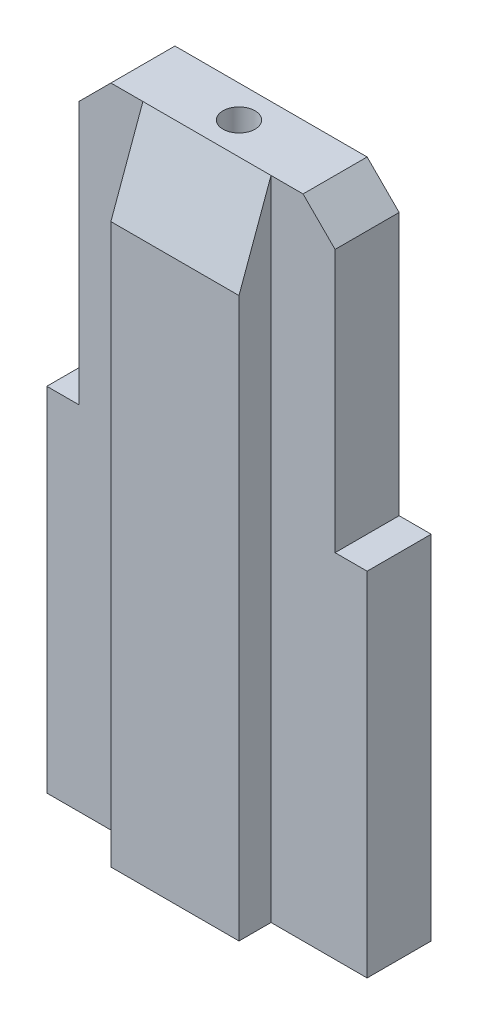
ISO-10303-21;
HEADER;
FILE_DESCRIPTION(('STEP AP214'),'2;1');
FILE_NAME('part.step','',(''),(''),'','','');
FILE_SCHEMA(('AUTOMOTIVE_DESIGN { 1 0 10303 214 1 1 1 1 }'));
ENDSEC;
DATA;
#1=APPLICATION_CONTEXT('core data for automotive mechanical design processes');
#2=APPLICATION_PROTOCOL_DEFINITION('international standard','automotive_design',2000,#1);
#3=PRODUCT_CONTEXT('',#1,'mechanical');
#4=PRODUCT('Part','Part','',(#3));
#5=PRODUCT_RELATED_PRODUCT_CATEGORY('part','',(#4));
#6=PRODUCT_DEFINITION_FORMATION('','',#4);
#7=PRODUCT_DEFINITION_CONTEXT('part definition',#1,'design');
#8=PRODUCT_DEFINITION('design','',#6,#7);
#9=PRODUCT_DEFINITION_SHAPE('','',#8);
#10=(LENGTH_UNIT() NAMED_UNIT(*) SI_UNIT(.MILLI.,.METRE.));
#11=(NAMED_UNIT(*) PLANE_ANGLE_UNIT() SI_UNIT($,.RADIAN.));
#12=(NAMED_UNIT(*) SI_UNIT($,.STERADIAN.) SOLID_ANGLE_UNIT());
#13=UNCERTAINTY_MEASURE_WITH_UNIT(LENGTH_MEASURE(1.E-05),#10,'distance_accuracy_value','');
#14=(GEOMETRIC_REPRESENTATION_CONTEXT(3) GLOBAL_UNCERTAINTY_ASSIGNED_CONTEXT((#13)) GLOBAL_UNIT_ASSIGNED_CONTEXT((#10,
#11,#12)) REPRESENTATION_CONTEXT('',''));
#15=CARTESIAN_POINT('',(0.,0.,0.));
#16=DIRECTION('',(0.,0.,1.));
#17=DIRECTION('',(1.,0.,0.));
#18=AXIS2_PLACEMENT_3D('',#15,#16,#17);
#19=CARTESIAN_POINT('',(0.,0.,-0.5));
#20=DIRECTION('',(0.,0.,1.));
#21=DIRECTION('',(1.,0.,0.));
#22=AXIS2_PLACEMENT_3D('',#19,#20,#21);
#23=PLANE('',#22);
#24=DIRECTION('',(0.,-1.,0.));
#25=VECTOR('',#24,1.);
#26=CARTESIAN_POINT('',(-2.,2.75,-0.5));
#27=LINE('',#26,#25);
#28=CARTESIAN_POINT('',(-2.,6.85,-0.5));
#29=VERTEX_POINT('',#28);
#30=CARTESIAN_POINT('',(-2.,2.75,-0.5));
#31=VERTEX_POINT('',#30);
#32=EDGE_CURVE('E267',#29,#31,#27,.T.);
#33=ORIENTED_EDGE('',*,*,#32,.F.);
#34=DIRECTION('',(-0.707106781186549,-0.707106781186546,0.));
#35=VECTOR('',#34,1.);
#36=CARTESIAN_POINT('',(-2.,6.85,-0.5));
#37=LINE('',#36,#35);
#38=CARTESIAN_POINT('',(-1.49999999999999,7.35,-0.5));
#39=VERTEX_POINT('',#38);
#40=EDGE_CURVE('E218',#29,#39,#37,.F.);
#41=ORIENTED_EDGE('',*,*,#40,.T.);
#42=DIRECTION('',(-1.,0.,0.));
#43=VECTOR('',#42,1.);
#44=CARTESIAN_POINT('',(-2.,7.35,-0.5));
#45=LINE('',#44,#43);
#46=CARTESIAN_POINT('',(-1.,7.35,-0.5));
#47=VERTEX_POINT('',#46);
#48=EDGE_CURVE('E264',#47,#39,#45,.T.);
#49=ORIENTED_EDGE('',*,*,#48,.F.);
#50=DIRECTION('',(0.,1.,0.));
#51=VECTOR('',#50,1.);
#52=CARTESIAN_POINT('',(-1.,7.35,-0.5));
#53=LINE('',#52,#51);
#54=CARTESIAN_POINT('',(-1.,-2.75,-0.5));
#55=VERTEX_POINT('',#54);
#56=EDGE_CURVE('E194',#55,#47,#53,.T.);
#57=ORIENTED_EDGE('',*,*,#56,.F.);
#58=DIRECTION('',(1.,0.,0.));
#59=VECTOR('',#58,1.);
#60=CARTESIAN_POINT('',(-2.5,-2.75,-0.5));
#61=LINE('',#60,#59);
#62=CARTESIAN_POINT('',(-2.5,-2.75,-0.5));
#63=VERTEX_POINT('',#62);
#64=EDGE_CURVE('E381',#63,#55,#61,.T.);
#65=ORIENTED_EDGE('',*,*,#64,.F.);
#66=DIRECTION('',(0.,-1.,0.));
#67=VECTOR('',#66,1.);
#68=CARTESIAN_POINT('',(-2.5,2.75,-0.5));
#69=LINE('',#68,#67);
#70=CARTESIAN_POINT('',(-2.5,2.75,-0.5));
#71=VERTEX_POINT('',#70);
#72=EDGE_CURVE('E418',#71,#63,#69,.T.);
#73=ORIENTED_EDGE('',*,*,#72,.F.);
#74=DIRECTION('',(-1.,0.,0.));
#75=VECTOR('',#74,1.);
#76=CARTESIAN_POINT('',(-2.5,2.75,-0.5));
#77=LINE('',#76,#75);
#78=EDGE_CURVE('E437',#31,#71,#77,.T.);
#79=ORIENTED_EDGE('',*,*,#78,.F.);
#80=EDGE_LOOP('',(#33,#41,#49,#57,#65,#73,#79));
#81=FACE_BOUND('',#80,.T.);
#82=ADVANCED_FACE('F32',(#81),#23,.F.);
#83=CARTESIAN_POINT('',(1.5,7.35,-0.5));
#84=VERTEX_POINT('',#83);
#85=CARTESIAN_POINT('',(0.999999999999999,7.35,-0.5));
#86=VERTEX_POINT('',#85);
#87=EDGE_CURVE('E230',#84,#86,#45,.T.);
#88=ORIENTED_EDGE('',*,*,#87,.F.);
#89=DIRECTION('',(-0.707106781186546,0.707106781186549,0.));
#90=VECTOR('',#89,1.);
#91=CARTESIAN_POINT('',(1.5,7.35,-0.5));
#92=LINE('',#91,#90);
#93=CARTESIAN_POINT('',(2.,6.85,-0.5));
#94=VERTEX_POINT('',#93);
#95=EDGE_CURVE('E55',#84,#94,#92,.F.);
#96=ORIENTED_EDGE('',*,*,#95,.T.);
#97=DIRECTION('',(0.,1.,0.));
#98=VECTOR('',#97,1.);
#99=CARTESIAN_POINT('',(2.,7.35,-0.5));
#100=LINE('',#99,#98);
#101=CARTESIAN_POINT('',(2.,2.75,-0.5));
#102=VERTEX_POINT('',#101);
#103=EDGE_CURVE('E263',#102,#94,#100,.T.);
#104=ORIENTED_EDGE('',*,*,#103,.F.);
#105=DIRECTION('',(-1.,0.,0.));
#106=VECTOR('',#105,1.);
#107=CARTESIAN_POINT('',(2.,2.75,-0.5));
#108=LINE('',#107,#106);
#109=CARTESIAN_POINT('',(2.5,2.75,-0.5));
#110=VERTEX_POINT('',#109);
#111=EDGE_CURVE('E260',#110,#102,#108,.T.);
#112=ORIENTED_EDGE('',*,*,#111,.F.);
#113=DIRECTION('',(0.,1.,0.));
#114=VECTOR('',#113,1.);
#115=CARTESIAN_POINT('',(2.5,2.75,-0.5));
#116=LINE('',#115,#114);
#117=CARTESIAN_POINT('',(2.5,-2.75,-0.5));
#118=VERTEX_POINT('',#117);
#119=EDGE_CURVE('E256',#118,#110,#116,.T.);
#120=ORIENTED_EDGE('',*,*,#119,.F.);
#121=CARTESIAN_POINT('',(0.999999999999999,-2.75,-0.5));
#122=VERTEX_POINT('',#121);
#123=EDGE_CURVE('E274',#122,#118,#61,.T.);
#124=ORIENTED_EDGE('',*,*,#123,.F.);
#125=DIRECTION('',(0.,-1.,0.));
#126=VECTOR('',#125,1.);
#127=CARTESIAN_POINT('',(1.,7.35,-0.5));
#128=LINE('',#127,#126);
#129=EDGE_CURVE('E176',#86,#122,#128,.T.);
#130=ORIENTED_EDGE('',*,*,#129,.F.);
#131=EDGE_LOOP('',(#88,#96,#104,#112,#120,#124,#130));
#132=FACE_BOUND('',#131,.T.);
#133=ADVANCED_FACE('F296',(#132),#23,.F.);
#134=CARTESIAN_POINT('',(0.,0.,0.5));
#135=DIRECTION('',(0.,0.,1.));
#136=DIRECTION('',(1.,0.,0.));
#137=AXIS2_PLACEMENT_3D('',#134,#135,#136);
#138=PLANE('',#137);
#139=DIRECTION('',(0.,1.,0.));
#140=VECTOR('',#139,1.);
#141=CARTESIAN_POINT('',(2.,7.35,0.5));
#142=LINE('',#141,#140);
#143=CARTESIAN_POINT('',(2.,2.75,0.5));
#144=VERTEX_POINT('',#143);
#145=CARTESIAN_POINT('',(2.,6.85,0.5));
#146=VERTEX_POINT('',#145);
#147=EDGE_CURVE('E236',#144,#146,#142,.T.);
#148=ORIENTED_EDGE('',*,*,#147,.T.);
#149=DIRECTION('',(0.707106781186546,-0.707106781186549,0.));
#150=VECTOR('',#149,1.);
#151=CARTESIAN_POINT('',(4.425,4.42499999999999,0.5));
#152=LINE('',#151,#150);
#153=CARTESIAN_POINT('',(1.5,7.35,0.5));
#154=VERTEX_POINT('',#153);
#155=EDGE_CURVE('E11',#146,#154,#152,.F.);
#156=ORIENTED_EDGE('',*,*,#155,.T.);
#157=DIRECTION('',(-1.,0.,0.));
#158=VECTOR('',#157,1.);
#159=CARTESIAN_POINT('',(-2.,7.35,0.5));
#160=LINE('',#159,#158);
#161=CARTESIAN_POINT('',(1.,7.35,0.5));
#162=VERTEX_POINT('',#161);
#163=EDGE_CURVE('E225',#154,#162,#160,.T.);
#164=ORIENTED_EDGE('',*,*,#163,.T.);
#165=DIRECTION('',(0.,1.,0.));
#166=VECTOR('',#165,1.);
#167=CARTESIAN_POINT('',(1.,7.35,0.5));
#168=LINE('',#167,#166);
#169=CARTESIAN_POINT('',(1.,-2.75,0.5));
#170=VERTEX_POINT('',#169);
#171=EDGE_CURVE('E178',#170,#162,#168,.T.);
#172=ORIENTED_EDGE('',*,*,#171,.F.);
#173=DIRECTION('',(1.,0.,0.));
#174=VECTOR('',#173,1.);
#175=CARTESIAN_POINT('',(-2.5,-2.75,0.5));
#176=LINE('',#175,#174);
#177=CARTESIAN_POINT('',(2.5,-2.75,0.5));
#178=VERTEX_POINT('',#177);
#179=EDGE_CURVE('E250',#170,#178,#176,.T.);
#180=ORIENTED_EDGE('',*,*,#179,.T.);
#181=DIRECTION('',(0.,1.,0.));
#182=VECTOR('',#181,1.);
#183=CARTESIAN_POINT('',(2.5,2.75,0.5));
#184=LINE('',#183,#182);
#185=CARTESIAN_POINT('',(2.5,2.75,0.5));
#186=VERTEX_POINT('',#185);
#187=EDGE_CURVE('E370',#178,#186,#184,.T.);
#188=ORIENTED_EDGE('',*,*,#187,.T.);
#189=DIRECTION('',(-1.,0.,0.));
#190=VECTOR('',#189,1.);
#191=CARTESIAN_POINT('',(2.,2.75,0.5));
#192=LINE('',#191,#190);
#193=EDGE_CURVE('E380',#186,#144,#192,.T.);
#194=ORIENTED_EDGE('',*,*,#193,.T.);
#195=EDGE_LOOP('',(#148,#156,#164,#172,#180,#188,#194));
#196=FACE_BOUND('',#195,.T.);
#197=ADVANCED_FACE('F302',(#196),#138,.T.);
#198=CARTESIAN_POINT('',(2.5,2.75,0.5));
#199=DIRECTION('',(-1.,0.,0.));
#200=DIRECTION('',(0.,-1.,0.));
#201=AXIS2_PLACEMENT_3D('',#198,#199,#200);
#202=PLANE('',#201);
#203=ORIENTED_EDGE('',*,*,#119,.T.);
#204=DIRECTION('',(0.,0.,-1.));
#205=VECTOR('',#204,1.);
#206=CARTESIAN_POINT('',(2.5,2.75,0.5));
#207=LINE('',#206,#205);
#208=EDGE_CURVE('E244',#186,#110,#207,.T.);
#209=ORIENTED_EDGE('',*,*,#208,.F.);
#210=ORIENTED_EDGE('',*,*,#187,.F.);
#211=DIRECTION('',(0.,0.,-1.));
#212=VECTOR('',#211,1.);
#213=CARTESIAN_POINT('',(2.5,-2.75,0.5));
#214=LINE('',#213,#212);
#215=EDGE_CURVE('E249',#178,#118,#214,.T.);
#216=ORIENTED_EDGE('',*,*,#215,.T.);
#217=EDGE_LOOP('',(#203,#209,#210,#216));
#218=FACE_BOUND('',#217,.T.);
#219=ADVANCED_FACE('F332',(#218),#202,.F.);
#220=CARTESIAN_POINT('',(2.,2.75,0.5));
#221=DIRECTION('',(0.,-1.,0.));
#222=DIRECTION('',(0.,0.,-1.));
#223=AXIS2_PLACEMENT_3D('',#220,#221,#222);
#224=PLANE('',#223);
#225=ORIENTED_EDGE('',*,*,#111,.T.);
#226=DIRECTION('',(0.,0.,-1.));
#227=VECTOR('',#226,1.);
#228=CARTESIAN_POINT('',(2.,2.75,0.5));
#229=LINE('',#228,#227);
#230=EDGE_CURVE('E426',#144,#102,#229,.T.);
#231=ORIENTED_EDGE('',*,*,#230,.F.);
#232=ORIENTED_EDGE('',*,*,#193,.F.);
#233=ORIENTED_EDGE('',*,*,#208,.T.);
#234=EDGE_LOOP('',(#225,#231,#232,#233));
#235=FACE_BOUND('',#234,.T.);
#236=ADVANCED_FACE('F329',(#235),#224,.F.);
#237=CARTESIAN_POINT('',(2.,7.35,0.5));
#238=DIRECTION('',(-1.,0.,0.));
#239=DIRECTION('',(0.,-1.,0.));
#240=AXIS2_PLACEMENT_3D('',#237,#238,#239);
#241=PLANE('',#240);
#242=ORIENTED_EDGE('',*,*,#103,.T.);
#243=DIRECTION('',(0.,0.,1.));
#244=VECTOR('',#243,1.);
#245=CARTESIAN_POINT('',(2.,6.85,0.5));
#246=LINE('',#245,#244);
#247=EDGE_CURVE('E41',#94,#146,#246,.T.);
#248=ORIENTED_EDGE('',*,*,#247,.T.);
#249=ORIENTED_EDGE('',*,*,#147,.F.);
#250=ORIENTED_EDGE('',*,*,#230,.T.);
#251=EDGE_LOOP('',(#242,#248,#249,#250));
#252=FACE_BOUND('',#251,.T.);
#253=ADVANCED_FACE('F325',(#252),#241,.F.);
#254=CARTESIAN_POINT('',(-2.,7.35,0.5));
#255=DIRECTION('',(0.,-1.,0.));
#256=DIRECTION('',(0.,0.,-1.));
#257=AXIS2_PLACEMENT_3D('',#254,#255,#256);
#258=PLANE('',#257);
#259=CARTESIAN_POINT('',(0.,7.35,0.));
#260=DIRECTION('',(0.,1.,0.));
#261=DIRECTION('',(0.,0.,1.));
#262=AXIS2_PLACEMENT_3D('',#259,#260,#261);
#263=CIRCLE('',#262,0.25);
#264=CARTESIAN_POINT('',(0.,7.35,0.25));
#265=VERTEX_POINT('',#264);
#266=EDGE_CURVE('E278',#265,#265,#263,.T.);
#267=ORIENTED_EDGE('',*,*,#266,.F.);
#268=EDGE_LOOP('',(#267));
#269=FACE_BOUND('',#268,.T.);
#270=ORIENTED_EDGE('',*,*,#163,.F.);
#271=DIRECTION('',(0.,0.,-1.));
#272=VECTOR('',#271,1.);
#273=CARTESIAN_POINT('',(1.5,7.35,0.5));
#274=LINE('',#273,#272);
#275=EDGE_CURVE('E224',#154,#84,#274,.T.);
#276=ORIENTED_EDGE('',*,*,#275,.T.);
#277=ORIENTED_EDGE('',*,*,#87,.T.);
#278=DIRECTION('',(-1.,0.,0.));
#279=VECTOR('',#278,1.);
#280=CARTESIAN_POINT('',(-1.,7.35,-0.5));
#281=LINE('',#280,#279);
#282=EDGE_CURVE('E205',#86,#47,#281,.T.);
#283=ORIENTED_EDGE('',*,*,#282,.T.);
#284=ORIENTED_EDGE('',*,*,#48,.T.);
#285=DIRECTION('',(0.,0.,1.));
#286=VECTOR('',#285,1.);
#287=CARTESIAN_POINT('',(-1.49999999999999,7.35,0.5));
#288=LINE('',#287,#286);
#289=CARTESIAN_POINT('',(-1.49999999999999,7.35,0.5));
#290=VERTEX_POINT('',#289);
#291=EDGE_CURVE('E220',#39,#290,#288,.T.);
#292=ORIENTED_EDGE('',*,*,#291,.T.);
#293=CARTESIAN_POINT('',(-0.999999999999999,7.35,0.5));
#294=VERTEX_POINT('',#293);
#295=EDGE_CURVE('E229',#294,#290,#160,.T.);
#296=ORIENTED_EDGE('',*,*,#295,.F.);
#297=DIRECTION('',(1.,0.,0.));
#298=VECTOR('',#297,1.);
#299=CARTESIAN_POINT('',(1.,7.35,0.5));
#300=LINE('',#299,#298);
#301=EDGE_CURVE('E407',#294,#162,#300,.T.);
#302=ORIENTED_EDGE('',*,*,#301,.T.);
#303=EDGE_LOOP('',(#270,#276,#277,#283,#284,#292,#296,#302));
#304=FACE_BOUND('',#303,.T.);
#305=ADVANCED_FACE('F321',(#269,#304),#258,.F.);
#306=CARTESIAN_POINT('',(-2.,2.75,0.5));
#307=DIRECTION('',(1.,0.,0.));
#308=DIRECTION('',(0.,0.,-1.));
#309=AXIS2_PLACEMENT_3D('',#306,#307,#308);
#310=PLANE('',#309);
#311=DIRECTION('',(0.,-1.,0.));
#312=VECTOR('',#311,1.);
#313=CARTESIAN_POINT('',(-2.,2.75,0.5));
#314=LINE('',#313,#312);
#315=CARTESIAN_POINT('',(-2.,6.85,0.5));
#316=VERTEX_POINT('',#315);
#317=CARTESIAN_POINT('',(-2.,2.75,0.5));
#318=VERTEX_POINT('',#317);
#319=EDGE_CURVE('E228',#316,#318,#314,.T.);
#320=ORIENTED_EDGE('',*,*,#319,.F.);
#321=DIRECTION('',(0.,0.,-1.));
#322=VECTOR('',#321,1.);
#323=CARTESIAN_POINT('',(-2.,6.85,0.5));
#324=LINE('',#323,#322);
#325=EDGE_CURVE('E213',#316,#29,#324,.T.);
#326=ORIENTED_EDGE('',*,*,#325,.T.);
#327=ORIENTED_EDGE('',*,*,#32,.T.);
#328=DIRECTION('',(0.,0.,-1.));
#329=VECTOR('',#328,1.);
#330=CARTESIAN_POINT('',(-2.,2.75,0.5));
#331=LINE('',#330,#329);
#332=EDGE_CURVE('E359',#318,#31,#331,.T.);
#333=ORIENTED_EDGE('',*,*,#332,.F.);
#334=EDGE_LOOP('',(#320,#326,#327,#333));
#335=FACE_BOUND('',#334,.T.);
#336=ADVANCED_FACE('F317',(#335),#310,.F.);
#337=CARTESIAN_POINT('',(-2.5,2.75,0.5));
#338=DIRECTION('',(0.,-1.,0.));
#339=DIRECTION('',(0.,0.,-1.));
#340=AXIS2_PLACEMENT_3D('',#337,#338,#339);
#341=PLANE('',#340);
#342=ORIENTED_EDGE('',*,*,#78,.T.);
#343=DIRECTION('',(0.,0.,-1.));
#344=VECTOR('',#343,1.);
#345=CARTESIAN_POINT('',(-2.5,2.75,0.5));
#346=LINE('',#345,#344);
#347=CARTESIAN_POINT('',(-2.5,2.75,0.5));
#348=VERTEX_POINT('',#347);
#349=EDGE_CURVE('E423',#348,#71,#346,.T.);
#350=ORIENTED_EDGE('',*,*,#349,.F.);
#351=DIRECTION('',(-1.,0.,0.));
#352=VECTOR('',#351,1.);
#353=CARTESIAN_POINT('',(-2.5,2.75,0.5));
#354=LINE('',#353,#352);
#355=EDGE_CURVE('E361',#318,#348,#354,.T.);
#356=ORIENTED_EDGE('',*,*,#355,.F.);
#357=ORIENTED_EDGE('',*,*,#332,.T.);
#358=EDGE_LOOP('',(#342,#350,#356,#357));
#359=FACE_BOUND('',#358,.T.);
#360=ADVANCED_FACE('F313',(#359),#341,.F.);
#361=CARTESIAN_POINT('',(-2.5,2.75,0.5));
#362=DIRECTION('',(1.,0.,0.));
#363=DIRECTION('',(0.,1.,0.));
#364=AXIS2_PLACEMENT_3D('',#361,#362,#363);
#365=PLANE('',#364);
#366=ORIENTED_EDGE('',*,*,#72,.T.);
#367=DIRECTION('',(0.,0.,-1.));
#368=VECTOR('',#367,1.);
#369=CARTESIAN_POINT('',(-2.5,-2.75,0.5));
#370=LINE('',#369,#368);
#371=CARTESIAN_POINT('',(-2.5,-2.75,0.5));
#372=VERTEX_POINT('',#371);
#373=EDGE_CURVE('E377',#372,#63,#370,.T.);
#374=ORIENTED_EDGE('',*,*,#373,.F.);
#375=DIRECTION('',(0.,-1.,0.));
#376=VECTOR('',#375,1.);
#377=CARTESIAN_POINT('',(-2.5,2.75,0.5));
#378=LINE('',#377,#376);
#379=EDGE_CURVE('E255',#348,#372,#378,.T.);
#380=ORIENTED_EDGE('',*,*,#379,.F.);
#381=ORIENTED_EDGE('',*,*,#349,.T.);
#382=EDGE_LOOP('',(#366,#374,#380,#381));
#383=FACE_BOUND('',#382,.T.);
#384=ADVANCED_FACE('F310',(#383),#365,.F.);
#385=CARTESIAN_POINT('',(-2.5,-2.75,0.5));
#386=DIRECTION('',(0.,1.,0.));
#387=DIRECTION('',(0.,0.,1.));
#388=AXIS2_PLACEMENT_3D('',#385,#386,#387);
#389=PLANE('',#388);
#390=CARTESIAN_POINT('',(0.,-2.75,0.));
#391=DIRECTION('',(0.,1.,0.));
#392=DIRECTION('',(0.,0.,1.));
#393=AXIS2_PLACEMENT_3D('',#390,#391,#392);
#394=CIRCLE('',#393,0.25);
#395=CARTESIAN_POINT('',(0.,-2.75,0.25));
#396=VERTEX_POINT('',#395);
#397=EDGE_CURVE('E36',#396,#396,#394,.T.);
#398=ORIENTED_EDGE('',*,*,#397,.T.);
#399=EDGE_LOOP('',(#398));
#400=FACE_BOUND('',#399,.T.);
#401=ORIENTED_EDGE('',*,*,#64,.T.);
#402=DIRECTION('',(0.,0.,1.));
#403=VECTOR('',#402,1.);
#404=CARTESIAN_POINT('',(-1.,-2.75,-1.));
#405=LINE('',#404,#403);
#406=CARTESIAN_POINT('',(-1.,-2.75,-1.));
#407=VERTEX_POINT('',#406);
#408=EDGE_CURVE('E179',#407,#55,#405,.T.);
#409=ORIENTED_EDGE('',*,*,#408,.F.);
#410=DIRECTION('',(-1.,0.,0.));
#411=VECTOR('',#410,1.);
#412=CARTESIAN_POINT('',(0.999999999999999,-2.75,-1.));
#413=LINE('',#412,#411);
#414=CARTESIAN_POINT('',(0.999999999999999,-2.75,-1.));
#415=VERTEX_POINT('',#414);
#416=EDGE_CURVE('E163',#415,#407,#413,.T.);
#417=ORIENTED_EDGE('',*,*,#416,.F.);
#418=DIRECTION('',(0.,0.,1.));
#419=VECTOR('',#418,1.);
#420=CARTESIAN_POINT('',(0.999999999999999,-2.75,-1.));
#421=LINE('',#420,#419);
#422=EDGE_CURVE('E173',#415,#122,#421,.T.);
#423=ORIENTED_EDGE('',*,*,#422,.T.);
#424=ORIENTED_EDGE('',*,*,#123,.T.);
#425=ORIENTED_EDGE('',*,*,#215,.F.);
#426=ORIENTED_EDGE('',*,*,#179,.F.);
#427=DIRECTION('',(0.,0.,-1.));
#428=VECTOR('',#427,1.);
#429=CARTESIAN_POINT('',(1.,-2.75,1.));
#430=LINE('',#429,#428);
#431=CARTESIAN_POINT('',(1.,-2.75,1.));
#432=VERTEX_POINT('',#431);
#433=EDGE_CURVE('E394',#432,#170,#430,.T.);
#434=ORIENTED_EDGE('',*,*,#433,.F.);
#435=DIRECTION('',(1.,0.,0.));
#436=VECTOR('',#435,1.);
#437=CARTESIAN_POINT('',(-0.999999999999998,-2.75,1.));
#438=LINE('',#437,#436);
#439=CARTESIAN_POINT('',(-0.999999999999998,-2.75,1.));
#440=VERTEX_POINT('',#439);
#441=EDGE_CURVE('E399',#440,#432,#438,.T.);
#442=ORIENTED_EDGE('',*,*,#441,.F.);
#443=DIRECTION('',(0.,0.,-1.));
#444=VECTOR('',#443,1.);
#445=CARTESIAN_POINT('',(-0.999999999999998,-2.75,1.));
#446=LINE('',#445,#444);
#447=CARTESIAN_POINT('',(-0.999999999999998,-2.75,0.5));
#448=VERTEX_POINT('',#447);
#449=EDGE_CURVE('E261',#440,#448,#446,.T.);
#450=ORIENTED_EDGE('',*,*,#449,.T.);
#451=EDGE_CURVE('E246',#372,#448,#176,.T.);
#452=ORIENTED_EDGE('',*,*,#451,.F.);
#453=ORIENTED_EDGE('',*,*,#373,.T.);
#454=EDGE_LOOP('',(#401,#409,#417,#423,#424,#425,#426,#434,#442,#450,#452,#453));
#455=FACE_BOUND('',#454,.T.);
#456=ADVANCED_FACE('F182',(#400,#455),#389,.F.);
#457=ORIENTED_EDGE('',*,*,#295,.T.);
#458=DIRECTION('',(0.707106781186549,0.707106781186546,0.));
#459=VECTOR('',#458,1.);
#460=CARTESIAN_POINT('',(-4.42499999999999,4.42500000000001,0.5));
#461=LINE('',#460,#459);
#462=EDGE_CURVE('E222',#290,#316,#461,.F.);
#463=ORIENTED_EDGE('',*,*,#462,.T.);
#464=ORIENTED_EDGE('',*,*,#319,.T.);
#465=ORIENTED_EDGE('',*,*,#355,.T.);
#466=ORIENTED_EDGE('',*,*,#379,.T.);
#467=ORIENTED_EDGE('',*,*,#451,.T.);
#468=DIRECTION('',(0.,-1.,0.));
#469=VECTOR('',#468,1.);
#470=CARTESIAN_POINT('',(-0.999999999999999,7.35,0.5));
#471=LINE('',#470,#469);
#472=EDGE_CURVE('E388',#294,#448,#471,.T.);
#473=ORIENTED_EDGE('',*,*,#472,.F.);
#474=EDGE_LOOP('',(#457,#463,#464,#465,#466,#467,#473));
#475=FACE_BOUND('',#474,.T.);
#476=ADVANCED_FACE('F306',(#475),#138,.T.);
#477=CARTESIAN_POINT('',(1.,7.35,1.));
#478=DIRECTION('',(-1.,0.,0.));
#479=DIRECTION('',(0.,-1.,0.));
#480=AXIS2_PLACEMENT_3D('',#477,#478,#479);
#481=PLANE('',#480);
#482=ORIENTED_EDGE('',*,*,#171,.T.);
#483=DIRECTION('',(0.,-0.939692620785908,0.342020143325669));
#484=VECTOR('',#483,1.);
#485=CARTESIAN_POINT('',(1.,5.97626129027269,1.));
#486=LINE('',#485,#484);
#487=CARTESIAN_POINT('',(1.,5.97626129027269,0.999999999999999));
#488=VERTEX_POINT('',#487);
#489=EDGE_CURVE('E203',#162,#488,#486,.T.);
#490=ORIENTED_EDGE('',*,*,#489,.T.);
#491=DIRECTION('',(0.,1.,0.));
#492=VECTOR('',#491,1.);
#493=CARTESIAN_POINT('',(1.,7.35,1.));
#494=LINE('',#493,#492);
#495=EDGE_CURVE('E391',#432,#488,#494,.T.);
#496=ORIENTED_EDGE('',*,*,#495,.F.);
#497=ORIENTED_EDGE('',*,*,#433,.T.);
#498=EDGE_LOOP('',(#482,#490,#496,#497));
#499=FACE_BOUND('',#498,.T.);
#500=ADVANCED_FACE('F451',(#499),#481,.F.);
#501=CARTESIAN_POINT('',(-0.999999999999999,7.35,1.));
#502=DIRECTION('',(1.,0.,0.));
#503=DIRECTION('',(0.,1.,0.));
#504=AXIS2_PLACEMENT_3D('',#501,#502,#503);
#505=PLANE('',#504);
#506=DIRECTION('',(0.,-1.,0.));
#507=VECTOR('',#506,1.);
#508=CARTESIAN_POINT('',(-0.999999999999999,7.35,1.));
#509=LINE('',#508,#507);
#510=CARTESIAN_POINT('',(-0.999999999999999,5.97626129027269,0.999999999999999));
#511=VERTEX_POINT('',#510);
#512=EDGE_CURVE('E455',#511,#440,#509,.T.);
#513=ORIENTED_EDGE('',*,*,#512,.F.);
#514=DIRECTION('',(0.,0.939692620785908,-0.342020143325669));
#515=VECTOR('',#514,1.);
#516=CARTESIAN_POINT('',(-0.999999999999999,5.97626129027269,1.));
#517=LINE('',#516,#515);
#518=EDGE_CURVE('E405',#511,#294,#517,.T.);
#519=ORIENTED_EDGE('',*,*,#518,.T.);
#520=ORIENTED_EDGE('',*,*,#472,.T.);
#521=ORIENTED_EDGE('',*,*,#449,.F.);
#522=EDGE_LOOP('',(#513,#519,#520,#521));
#523=FACE_BOUND('',#522,.T.);
#524=ADVANCED_FACE('F459',(#523),#505,.F.);
#525=CARTESIAN_POINT('',(0.,0.,1.));
#526=DIRECTION('',(0.,0.,1.));
#527=DIRECTION('',(1.,0.,0.));
#528=AXIS2_PLACEMENT_3D('',#525,#526,#527);
#529=PLANE('',#528);
#530=ORIENTED_EDGE('',*,*,#495,.T.);
#531=DIRECTION('',(-1.,0.,0.));
#532=VECTOR('',#531,1.);
#533=CARTESIAN_POINT('',(-0.999999999999999,5.97626129027269,1.));
#534=LINE('',#533,#532);
#535=EDGE_CURVE('E402',#488,#511,#534,.T.);
#536=ORIENTED_EDGE('',*,*,#535,.T.);
#537=ORIENTED_EDGE('',*,*,#512,.T.);
#538=ORIENTED_EDGE('',*,*,#441,.T.);
#539=EDGE_LOOP('',(#530,#536,#537,#538));
#540=FACE_BOUND('',#539,.T.);
#541=ADVANCED_FACE('F341',(#540),#529,.T.);
#542=CARTESIAN_POINT('',(0.,5.97626129027269,1.));
#543=DIRECTION('',(0.,0.342020143325669,0.939692620785908));
#544=DIRECTION('',(1.,0.,0.));
#545=AXIS2_PLACEMENT_3D('',#542,#543,#544);
#546=PLANE('',#545);
#547=ORIENTED_EDGE('',*,*,#489,.F.);
#548=ORIENTED_EDGE('',*,*,#301,.F.);
#549=ORIENTED_EDGE('',*,*,#518,.F.);
#550=ORIENTED_EDGE('',*,*,#535,.F.);
#551=EDGE_LOOP('',(#547,#548,#549,#550));
#552=FACE_BOUND('',#551,.T.);
#553=ADVANCED_FACE('F337',(#552),#546,.T.);
#554=CARTESIAN_POINT('',(-1.,7.35,-1.));
#555=DIRECTION('',(1.,0.,0.));
#556=DIRECTION('',(0.,1.,0.));
#557=AXIS2_PLACEMENT_3D('',#554,#555,#556);
#558=PLANE('',#557);
#559=ORIENTED_EDGE('',*,*,#56,.T.);
#560=DIRECTION('',(0.,-0.939692620785908,-0.342020143325669));
#561=VECTOR('',#560,1.);
#562=CARTESIAN_POINT('',(-1.,5.97626129027269,-1.));
#563=LINE('',#562,#561);
#564=CARTESIAN_POINT('',(-1.,5.97626129027269,-0.999999999999999));
#565=VERTEX_POINT('',#564);
#566=EDGE_CURVE('E209',#47,#565,#563,.T.);
#567=ORIENTED_EDGE('',*,*,#566,.T.);
#568=DIRECTION('',(0.,1.,0.));
#569=VECTOR('',#568,1.);
#570=CARTESIAN_POINT('',(-1.,7.35,-1.));
#571=LINE('',#570,#569);
#572=EDGE_CURVE('E169',#407,#565,#571,.T.);
#573=ORIENTED_EDGE('',*,*,#572,.F.);
#574=ORIENTED_EDGE('',*,*,#408,.T.);
#575=EDGE_LOOP('',(#559,#567,#573,#574));
#576=FACE_BOUND('',#575,.T.);
#577=ADVANCED_FACE('F340',(#576),#558,.F.);
#578=CARTESIAN_POINT('',(1.,7.35,-1.));
#579=DIRECTION('',(-1.,0.,0.));
#580=DIRECTION('',(0.,-1.,0.));
#581=AXIS2_PLACEMENT_3D('',#578,#579,#580);
#582=PLANE('',#581);
#583=DIRECTION('',(0.,-1.,0.));
#584=VECTOR('',#583,1.);
#585=CARTESIAN_POINT('',(1.,7.35,-1.));
#586=LINE('',#585,#584);
#587=CARTESIAN_POINT('',(0.999999999999999,5.97626129027269,-0.999999999999999));
#588=VERTEX_POINT('',#587);
#589=EDGE_CURVE('E158',#588,#415,#586,.T.);
#590=ORIENTED_EDGE('',*,*,#589,.F.);
#591=DIRECTION('',(0.,0.939692620785908,0.342020143325669));
#592=VECTOR('',#591,1.);
#593=CARTESIAN_POINT('',(0.999999999999999,5.97626129027269,-1.));
#594=LINE('',#593,#592);
#595=EDGE_CURVE('E202',#588,#86,#594,.T.);
#596=ORIENTED_EDGE('',*,*,#595,.T.);
#597=ORIENTED_EDGE('',*,*,#129,.T.);
#598=ORIENTED_EDGE('',*,*,#422,.F.);
#599=EDGE_LOOP('',(#590,#596,#597,#598));
#600=FACE_BOUND('',#599,.T.);
#601=ADVANCED_FACE('F174',(#600),#582,.F.);
#602=CARTESIAN_POINT('',(0.,0.,-1.));
#603=DIRECTION('',(0.,0.,-1.));
#604=DIRECTION('',(-1.,0.,0.));
#605=AXIS2_PLACEMENT_3D('',#602,#603,#604);
#606=PLANE('',#605);
#607=ORIENTED_EDGE('',*,*,#572,.T.);
#608=DIRECTION('',(1.,0.,0.));
#609=VECTOR('',#608,1.);
#610=CARTESIAN_POINT('',(1.,5.97626129027269,-1.));
#611=LINE('',#610,#609);
#612=EDGE_CURVE('E166',#565,#588,#611,.T.);
#613=ORIENTED_EDGE('',*,*,#612,.T.);
#614=ORIENTED_EDGE('',*,*,#589,.T.);
#615=ORIENTED_EDGE('',*,*,#416,.T.);
#616=EDGE_LOOP('',(#607,#613,#614,#615));
#617=FACE_BOUND('',#616,.T.);
#618=ADVANCED_FACE('F161',(#617),#606,.T.);
#619=CARTESIAN_POINT('',(0.,5.97626129027269,-1.));
#620=DIRECTION('',(0.,0.342020143325669,-0.939692620785908));
#621=DIRECTION('',(-1.,0.,0.));
#622=AXIS2_PLACEMENT_3D('',#619,#620,#621);
#623=PLANE('',#622);
#624=ORIENTED_EDGE('',*,*,#566,.F.);
#625=ORIENTED_EDGE('',*,*,#282,.F.);
#626=ORIENTED_EDGE('',*,*,#595,.F.);
#627=ORIENTED_EDGE('',*,*,#612,.F.);
#628=EDGE_LOOP('',(#624,#625,#626,#627));
#629=FACE_BOUND('',#628,.T.);
#630=ADVANCED_FACE('F343',(#629),#623,.T.);
#631=CARTESIAN_POINT('',(-2.,6.85,0.5));
#632=DIRECTION('',(0.707106781186546,-0.707106781186549,0.));
#633=DIRECTION('',(0.,0.,-1.));
#634=AXIS2_PLACEMENT_3D('',#631,#632,#633);
#635=PLANE('',#634);
#636=ORIENTED_EDGE('',*,*,#462,.F.);
#637=ORIENTED_EDGE('',*,*,#291,.F.);
#638=ORIENTED_EDGE('',*,*,#40,.F.);
#639=ORIENTED_EDGE('',*,*,#325,.F.);
#640=EDGE_LOOP('',(#636,#637,#638,#639));
#641=FACE_BOUND('',#640,.T.);
#642=ADVANCED_FACE('F292',(#641),#635,.F.);
#643=CARTESIAN_POINT('',(1.5,7.35,0.5));
#644=DIRECTION('',(-0.707106781186549,-0.707106781186546,0.));
#645=DIRECTION('',(0.,0.,-1.));
#646=AXIS2_PLACEMENT_3D('',#643,#644,#645);
#647=PLANE('',#646);
#648=ORIENTED_EDGE('',*,*,#155,.F.);
#649=ORIENTED_EDGE('',*,*,#247,.F.);
#650=ORIENTED_EDGE('',*,*,#95,.F.);
#651=ORIENTED_EDGE('',*,*,#275,.F.);
#652=EDGE_LOOP('',(#648,#649,#650,#651));
#653=FACE_BOUND('',#652,.T.);
#654=ADVANCED_FACE('F34',(#653),#647,.F.);
#655=CARTESIAN_POINT('',(0.,-2.75005,0.));
#656=DIRECTION('',(0.,1.,0.));
#657=DIRECTION('',(0.,0.,1.));
#658=AXIS2_PLACEMENT_3D('',#655,#656,#657);
#659=CYLINDRICAL_SURFACE('',#658,0.25);
#660=ORIENTED_EDGE('',*,*,#266,.T.);
#661=EDGE_LOOP('',(#660));
#662=FACE_BOUND('',#661,.T.);
#663=ORIENTED_EDGE('',*,*,#397,.F.);
#664=EDGE_LOOP('',(#663));
#665=FACE_BOUND('',#664,.T.);
#666=ADVANCED_FACE('F286',(#662,#665),#659,.F.);
#667=CLOSED_SHELL('',(#82,#133,#197,#219,#236,#253,#305,#336,#360,#384,#456,#476,#500,#524,#541,
#553,#577,#601,#618,#630,#642,#654,#666));
#668=MANIFOLD_SOLID_BREP('B2',#667);
#669=ADVANCED_BREP_SHAPE_REPRESENTATION('',(#18,#668),#14);
#670=SHAPE_DEFINITION_REPRESENTATION(#9,#669);
ENDSEC;
END-ISO-10303-21;
